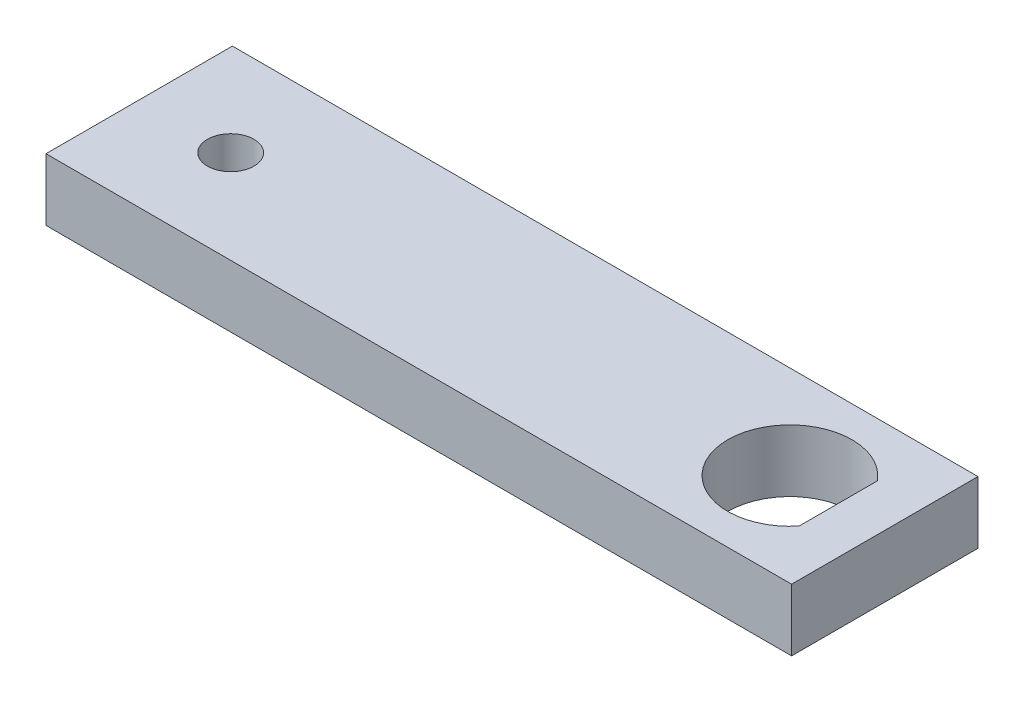
ISO-10303-21;
HEADER;
FILE_DESCRIPTION(('STEP AP214'),'2;1');
FILE_NAME('part.step','',(''),(''),'','','');
FILE_SCHEMA(('AUTOMOTIVE_DESIGN { 1 0 10303 214 1 1 1 1 }'));
ENDSEC;
DATA;
#1=APPLICATION_CONTEXT('core data for automotive mechanical design processes');
#2=APPLICATION_PROTOCOL_DEFINITION('international standard','automotive_design',2000,#1);
#3=PRODUCT_CONTEXT('',#1,'mechanical');
#4=PRODUCT('Part','Part','',(#3));
#5=PRODUCT_RELATED_PRODUCT_CATEGORY('part','',(#4));
#6=PRODUCT_DEFINITION_FORMATION('','',#4);
#7=PRODUCT_DEFINITION_CONTEXT('part definition',#1,'design');
#8=PRODUCT_DEFINITION('design','',#6,#7);
#9=PRODUCT_DEFINITION_SHAPE('','',#8);
#10=(LENGTH_UNIT() NAMED_UNIT(*) SI_UNIT(.MILLI.,.METRE.));
#11=(NAMED_UNIT(*) PLANE_ANGLE_UNIT() SI_UNIT($,.RADIAN.));
#12=(NAMED_UNIT(*) SI_UNIT($,.STERADIAN.) SOLID_ANGLE_UNIT());
#13=UNCERTAINTY_MEASURE_WITH_UNIT(LENGTH_MEASURE(1.E-05),#10,'distance_accuracy_value','');
#14=(GEOMETRIC_REPRESENTATION_CONTEXT(3) GLOBAL_UNCERTAINTY_ASSIGNED_CONTEXT((#13)) GLOBAL_UNIT_ASSIGNED_CONTEXT((#10,
#11,#12)) REPRESENTATION_CONTEXT('',''));
#15=CARTESIAN_POINT('',(0.,0.,0.));
#16=DIRECTION('',(0.,0.,1.));
#17=DIRECTION('',(1.,0.,0.));
#18=AXIS2_PLACEMENT_3D('',#15,#16,#17);
#19=CARTESIAN_POINT('',(0.,6.35,0.));
#20=DIRECTION('',(0.,-1.,0.));
#21=DIRECTION('',(0.,0.,-1.));
#22=AXIS2_PLACEMENT_3D('',#19,#20,#21);
#23=PLANE('',#22);
#24=CARTESIAN_POINT('',(-28.75,6.35,-9.525));
#25=DIRECTION('',(0.,1.,0.));
#26=DIRECTION('',(0.,0.,1.));
#27=AXIS2_PLACEMENT_3D('',#24,#25,#26);
#28=CIRCLE('',#27,2.38);
#29=CARTESIAN_POINT('',(-28.75,6.35,-7.145));
#30=VERTEX_POINT('',#29);
#31=EDGE_CURVE('E117',#30,#30,#28,.T.);
#32=ORIENTED_EDGE('',*,*,#31,.F.);
#33=EDGE_LOOP('',(#32));
#34=FACE_BOUND('',#33,.T.);
#35=DIRECTION('',(0.,0.,1.));
#36=VECTOR('',#35,1.);
#37=CARTESIAN_POINT('',(-38.1,6.35,0.));
#38=LINE('',#37,#36);
#39=CARTESIAN_POINT('',(-38.1,6.35,-19.05));
#40=VERTEX_POINT('',#39);
#41=CARTESIAN_POINT('',(-38.1,6.35,0.));
#42=VERTEX_POINT('',#41);
#43=EDGE_CURVE('E125',#40,#42,#38,.T.);
#44=ORIENTED_EDGE('',*,*,#43,.T.);
#45=DIRECTION('',(1.,0.,0.));
#46=VECTOR('',#45,1.);
#47=CARTESIAN_POINT('',(-38.1,6.35,0.));
#48=LINE('',#47,#46);
#49=CARTESIAN_POINT('',(38.1,6.35,0.));
#50=VERTEX_POINT('',#49);
#51=EDGE_CURVE('E129',#42,#50,#48,.T.);
#52=ORIENTED_EDGE('',*,*,#51,.T.);
#53=DIRECTION('',(0.,0.,-1.));
#54=VECTOR('',#53,1.);
#55=CARTESIAN_POINT('',(38.1,6.35,0.));
#56=LINE('',#55,#54);
#57=CARTESIAN_POINT('',(38.1,6.35,-19.05));
#58=VERTEX_POINT('',#57);
#59=EDGE_CURVE('E133',#50,#58,#56,.T.);
#60=ORIENTED_EDGE('',*,*,#59,.T.);
#61=DIRECTION('',(-1.,0.,0.));
#62=VECTOR('',#61,1.);
#63=CARTESIAN_POINT('',(-38.1,6.35,-19.05));
#64=LINE('',#63,#62);
#65=EDGE_CURVE('E136',#58,#40,#64,.T.);
#66=ORIENTED_EDGE('',*,*,#65,.T.);
#67=EDGE_LOOP('',(#44,#52,#60,#66));
#68=FACE_BOUND('',#67,.T.);
#69=CARTESIAN_POINT('',(28.4,6.35,-9.525));
#70=DIRECTION('',(0.,1.,0.));
#71=DIRECTION('',(0.,0.,1.));
#72=AXIS2_PLACEMENT_3D('',#69,#70,#71);
#73=CIRCLE('',#72,6.35);
#74=CARTESIAN_POINT('',(33.34,6.35,-13.5148496212263));
#75=VERTEX_POINT('',#74);
#76=CARTESIAN_POINT('',(33.34,6.35,-5.53515037877365));
#77=VERTEX_POINT('',#76);
#78=EDGE_CURVE('E101',#75,#77,#73,.T.);
#79=ORIENTED_EDGE('',*,*,#78,.F.);
#80=DIRECTION('',(0.,0.,-1.));
#81=VECTOR('',#80,1.);
#82=CARTESIAN_POINT('',(33.34,6.35,-13.5148496212263));
#83=LINE('',#82,#81);
#84=EDGE_CURVE('E94',#77,#75,#83,.T.);
#85=ORIENTED_EDGE('',*,*,#84,.F.);
#86=EDGE_LOOP('',(#79,#85));
#87=FACE_BOUND('',#86,.T.);
#88=ADVANCED_FACE('F41',(#34,#68,#87),#23,.F.);
#89=CARTESIAN_POINT('',(0.,0.,0.));
#90=DIRECTION('',(0.,-1.,0.));
#91=DIRECTION('',(0.,0.,-1.));
#92=AXIS2_PLACEMENT_3D('',#89,#90,#91);
#93=PLANE('',#92);
#94=DIRECTION('',(0.,0.,1.));
#95=VECTOR('',#94,1.);
#96=CARTESIAN_POINT('',(-38.1,0.,0.));
#97=LINE('',#96,#95);
#98=CARTESIAN_POINT('',(-38.1,0.,-19.05));
#99=VERTEX_POINT('',#98);
#100=CARTESIAN_POINT('',(-38.1,0.,0.));
#101=VERTEX_POINT('',#100);
#102=EDGE_CURVE('E121',#99,#101,#97,.T.);
#103=ORIENTED_EDGE('',*,*,#102,.F.);
#104=DIRECTION('',(-1.,0.,0.));
#105=VECTOR('',#104,1.);
#106=CARTESIAN_POINT('',(-38.1,0.,-19.05));
#107=LINE('',#106,#105);
#108=CARTESIAN_POINT('',(38.1,0.,-19.05));
#109=VERTEX_POINT('',#108);
#110=EDGE_CURVE('E130',#109,#99,#107,.T.);
#111=ORIENTED_EDGE('',*,*,#110,.F.);
#112=DIRECTION('',(0.,0.,-1.));
#113=VECTOR('',#112,1.);
#114=CARTESIAN_POINT('',(38.1,0.,0.));
#115=LINE('',#114,#113);
#116=CARTESIAN_POINT('',(38.1,0.,0.));
#117=VERTEX_POINT('',#116);
#118=EDGE_CURVE('E146',#117,#109,#115,.T.);
#119=ORIENTED_EDGE('',*,*,#118,.F.);
#120=DIRECTION('',(1.,0.,0.));
#121=VECTOR('',#120,1.);
#122=CARTESIAN_POINT('',(-38.1,0.,0.));
#123=LINE('',#122,#121);
#124=EDGE_CURVE('E143',#101,#117,#123,.T.);
#125=ORIENTED_EDGE('',*,*,#124,.F.);
#126=EDGE_LOOP('',(#103,#111,#119,#125));
#127=FACE_BOUND('',#126,.T.);
#128=CARTESIAN_POINT('',(-28.75,0.,-9.525));
#129=DIRECTION('',(0.,1.,0.));
#130=DIRECTION('',(0.,0.,1.));
#131=AXIS2_PLACEMENT_3D('',#128,#129,#130);
#132=CIRCLE('',#131,2.38);
#133=CARTESIAN_POINT('',(-28.75,0.,-7.145));
#134=VERTEX_POINT('',#133);
#135=EDGE_CURVE('E116',#134,#134,#132,.T.);
#136=ORIENTED_EDGE('',*,*,#135,.T.);
#137=EDGE_LOOP('',(#136));
#138=FACE_BOUND('',#137,.T.);
#139=DIRECTION('',(0.,0.,-1.));
#140=VECTOR('',#139,1.);
#141=CARTESIAN_POINT('',(33.34,0.,-13.5148496212263));
#142=LINE('',#141,#140);
#143=CARTESIAN_POINT('',(33.34,0.,-5.53515037877365));
#144=VERTEX_POINT('',#143);
#145=CARTESIAN_POINT('',(33.34,0.,-13.5148496212263));
#146=VERTEX_POINT('',#145);
#147=EDGE_CURVE('E107',#144,#146,#142,.T.);
#148=ORIENTED_EDGE('',*,*,#147,.T.);
#149=CARTESIAN_POINT('',(28.4,0.,-9.525));
#150=DIRECTION('',(0.,1.,0.));
#151=DIRECTION('',(0.,0.,1.));
#152=AXIS2_PLACEMENT_3D('',#149,#150,#151);
#153=CIRCLE('',#152,6.35);
#154=EDGE_CURVE('E64',#146,#144,#153,.T.);
#155=ORIENTED_EDGE('',*,*,#154,.T.);
#156=EDGE_LOOP('',(#148,#155));
#157=FACE_BOUND('',#156,.T.);
#158=ADVANCED_FACE('F169',(#127,#138,#157),#93,.T.);
#159=CARTESIAN_POINT('',(-38.1,6.35,0.));
#160=DIRECTION('',(1.,0.,0.));
#161=DIRECTION('',(0.,0.,-1.));
#162=AXIS2_PLACEMENT_3D('',#159,#160,#161);
#163=PLANE('',#162);
#164=ORIENTED_EDGE('',*,*,#102,.T.);
#165=DIRECTION('',(0.,-1.,0.));
#166=VECTOR('',#165,1.);
#167=CARTESIAN_POINT('',(-38.1,6.35,0.));
#168=LINE('',#167,#166);
#169=EDGE_CURVE('E11',#42,#101,#168,.T.);
#170=ORIENTED_EDGE('',*,*,#169,.F.);
#171=ORIENTED_EDGE('',*,*,#43,.F.);
#172=DIRECTION('',(0.,-1.,0.));
#173=VECTOR('',#172,1.);
#174=CARTESIAN_POINT('',(-38.1,6.35,-19.05));
#175=LINE('',#174,#173);
#176=EDGE_CURVE('E139',#40,#99,#175,.T.);
#177=ORIENTED_EDGE('',*,*,#176,.T.);
#178=EDGE_LOOP('',(#164,#170,#171,#177));
#179=FACE_BOUND('',#178,.T.);
#180=ADVANCED_FACE('F43',(#179),#163,.F.);
#181=CARTESIAN_POINT('',(-38.1,6.35,0.));
#182=DIRECTION('',(0.,0.,-1.));
#183=DIRECTION('',(-1.,0.,0.));
#184=AXIS2_PLACEMENT_3D('',#181,#182,#183);
#185=PLANE('',#184);
#186=ORIENTED_EDGE('',*,*,#124,.T.);
#187=DIRECTION('',(0.,-1.,0.));
#188=VECTOR('',#187,1.);
#189=CARTESIAN_POINT('',(38.1,6.35,0.));
#190=LINE('',#189,#188);
#191=EDGE_CURVE('E50',#50,#117,#190,.T.);
#192=ORIENTED_EDGE('',*,*,#191,.F.);
#193=ORIENTED_EDGE('',*,*,#51,.F.);
#194=ORIENTED_EDGE('',*,*,#169,.T.);
#195=EDGE_LOOP('',(#186,#192,#193,#194));
#196=FACE_BOUND('',#195,.T.);
#197=ADVANCED_FACE('F179',(#196),#185,.F.);
#198=CARTESIAN_POINT('',(38.1,6.35,0.));
#199=DIRECTION('',(-1.,0.,0.));
#200=DIRECTION('',(0.,0.,1.));
#201=AXIS2_PLACEMENT_3D('',#198,#199,#200);
#202=PLANE('',#201);
#203=ORIENTED_EDGE('',*,*,#118,.T.);
#204=DIRECTION('',(0.,-1.,0.));
#205=VECTOR('',#204,1.);
#206=CARTESIAN_POINT('',(38.1,6.35,-19.05));
#207=LINE('',#206,#205);
#208=EDGE_CURVE('E154',#58,#109,#207,.T.);
#209=ORIENTED_EDGE('',*,*,#208,.F.);
#210=ORIENTED_EDGE('',*,*,#59,.F.);
#211=ORIENTED_EDGE('',*,*,#191,.T.);
#212=EDGE_LOOP('',(#203,#209,#210,#211));
#213=FACE_BOUND('',#212,.T.);
#214=ADVANCED_FACE('F163',(#213),#202,.F.);
#215=CARTESIAN_POINT('',(-38.1,6.35,-19.05));
#216=DIRECTION('',(0.,0.,1.));
#217=DIRECTION('',(1.,0.,0.));
#218=AXIS2_PLACEMENT_3D('',#215,#216,#217);
#219=PLANE('',#218);
#220=ORIENTED_EDGE('',*,*,#110,.T.);
#221=ORIENTED_EDGE('',*,*,#176,.F.);
#222=ORIENTED_EDGE('',*,*,#65,.F.);
#223=ORIENTED_EDGE('',*,*,#208,.T.);
#224=EDGE_LOOP('',(#220,#221,#222,#223));
#225=FACE_BOUND('',#224,.T.);
#226=ADVANCED_FACE('F173',(#225),#219,.F.);
#227=CARTESIAN_POINT('',(-28.75,6.35,-9.525));
#228=DIRECTION('',(0.,-1.,0.));
#229=DIRECTION('',(0.,0.,-1.));
#230=AXIS2_PLACEMENT_3D('',#227,#228,#229);
#231=CYLINDRICAL_SURFACE('',#230,2.38);
#232=ORIENTED_EDGE('',*,*,#31,.T.);
#233=EDGE_LOOP('',(#232));
#234=FACE_BOUND('',#233,.T.);
#235=ORIENTED_EDGE('',*,*,#135,.F.);
#236=EDGE_LOOP('',(#235));
#237=FACE_BOUND('',#236,.T.);
#238=ADVANCED_FACE('F195',(#234,#237),#231,.F.);
#239=CARTESIAN_POINT('',(28.4,6.35,-9.525));
#240=DIRECTION('',(0.,-1.,0.));
#241=DIRECTION('',(0.,0.,-1.));
#242=AXIS2_PLACEMENT_3D('',#239,#240,#241);
#243=CYLINDRICAL_SURFACE('',#242,6.35);
#244=ORIENTED_EDGE('',*,*,#154,.F.);
#245=DIRECTION('',(0.,-1.,0.));
#246=VECTOR('',#245,1.);
#247=CARTESIAN_POINT('',(33.34,6.35,-13.5148496212263));
#248=LINE('',#247,#246);
#249=EDGE_CURVE('E96',#75,#146,#248,.T.);
#250=ORIENTED_EDGE('',*,*,#249,.F.);
#251=ORIENTED_EDGE('',*,*,#78,.T.);
#252=DIRECTION('',(0.,-1.,0.));
#253=VECTOR('',#252,1.);
#254=CARTESIAN_POINT('',(33.34,6.35,-5.53515037877365));
#255=LINE('',#254,#253);
#256=EDGE_CURVE('E57',#77,#144,#255,.T.);
#257=ORIENTED_EDGE('',*,*,#256,.T.);
#258=EDGE_LOOP('',(#244,#250,#251,#257));
#259=FACE_BOUND('',#258,.T.);
#260=ADVANCED_FACE('F103',(#259),#243,.F.);
#261=CARTESIAN_POINT('',(33.34,6.35,-13.5148496212263));
#262=DIRECTION('',(-1.,0.,0.));
#263=DIRECTION('',(0.,0.,1.));
#264=AXIS2_PLACEMENT_3D('',#261,#262,#263);
#265=PLANE('',#264);
#266=ORIENTED_EDGE('',*,*,#147,.F.);
#267=ORIENTED_EDGE('',*,*,#256,.F.);
#268=ORIENTED_EDGE('',*,*,#84,.T.);
#269=ORIENTED_EDGE('',*,*,#249,.T.);
#270=EDGE_LOOP('',(#266,#267,#268,#269));
#271=FACE_BOUND('',#270,.T.);
#272=ADVANCED_FACE('F95',(#271),#265,.T.);
#273=CLOSED_SHELL('',(#88,#158,#180,#197,#214,#226,#238,#260,#272));
#274=MANIFOLD_SOLID_BREP('B2',#273);
#275=ADVANCED_BREP_SHAPE_REPRESENTATION('',(#18,#274),#14);
#276=SHAPE_DEFINITION_REPRESENTATION(#9,#275);
ENDSEC;
END-ISO-10303-21;
